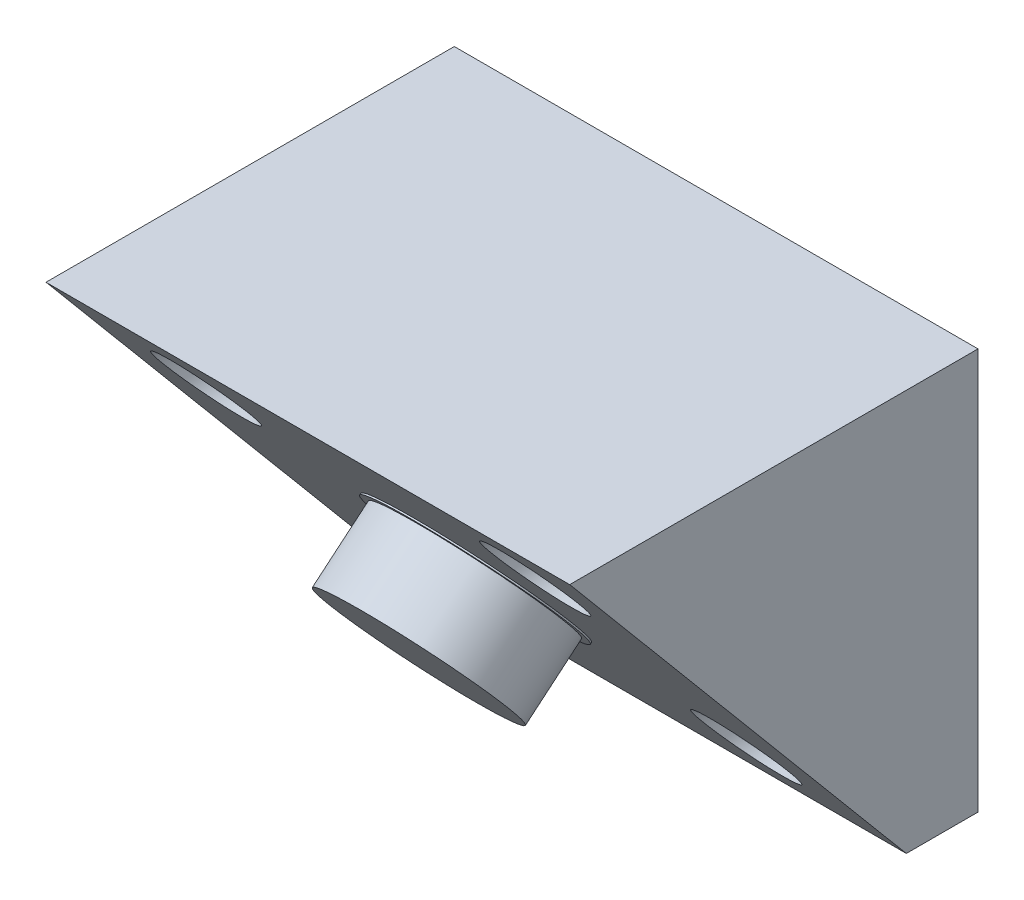
ISO-10303-21;
HEADER;
FILE_DESCRIPTION(('STEP AP214'),'2;1');
FILE_NAME('part.step','',(''),(''),'','','');
FILE_SCHEMA(('AUTOMOTIVE_DESIGN { 1 0 10303 214 1 1 1 1 }'));
ENDSEC;
DATA;
#1=APPLICATION_CONTEXT('core data for automotive mechanical design processes');
#2=APPLICATION_PROTOCOL_DEFINITION('international standard','automotive_design',2000,#1);
#3=PRODUCT_CONTEXT('',#1,'mechanical');
#4=PRODUCT('Part','Part','',(#3));
#5=PRODUCT_RELATED_PRODUCT_CATEGORY('part','',(#4));
#6=PRODUCT_DEFINITION_FORMATION('','',#4);
#7=PRODUCT_DEFINITION_CONTEXT('part definition',#1,'design');
#8=PRODUCT_DEFINITION('design','',#6,#7);
#9=PRODUCT_DEFINITION_SHAPE('','',#8);
#10=(LENGTH_UNIT() NAMED_UNIT(*) SI_UNIT(.MILLI.,.METRE.));
#11=(NAMED_UNIT(*) PLANE_ANGLE_UNIT() SI_UNIT($,.RADIAN.));
#12=(NAMED_UNIT(*) SI_UNIT($,.STERADIAN.) SOLID_ANGLE_UNIT());
#13=UNCERTAINTY_MEASURE_WITH_UNIT(LENGTH_MEASURE(1.E-05),#10,'distance_accuracy_value','');
#14=(GEOMETRIC_REPRESENTATION_CONTEXT(3) GLOBAL_UNCERTAINTY_ASSIGNED_CONTEXT((#13)) GLOBAL_UNIT_ASSIGNED_CONTEXT((#10,
#11,#12)) REPRESENTATION_CONTEXT('',''));
#15=CARTESIAN_POINT('',(0.,0.,0.));
#16=DIRECTION('',(0.,0.,1.));
#17=DIRECTION('',(1.,0.,0.));
#18=AXIS2_PLACEMENT_3D('',#15,#16,#17);
#19=CARTESIAN_POINT('',(35.,0.238005414940586,-27.0495609241047));
#20=DIRECTION('',(0.,1.,6.03609176530462E-13));
#21=DIRECTION('',(-1.,0.,0.));
#22=AXIS2_PLACEMENT_3D('',#19,#20,#21);
#23=PLANE('',#22);
#24=DIRECTION('',(0.,6.03609176530462E-13,-1.));
#25=VECTOR('',#24,1.);
#26=CARTESIAN_POINT('',(0.,0.238005414940586,-27.0495609241047));
#27=LINE('',#26,#25);
#28=CARTESIAN_POINT('',(0.,0.238005414937694,-22.2595609241047));
#29=VERTEX_POINT('',#28);
#30=CARTESIAN_POINT('',(0.,0.238005414940586,-27.0495609241047));
#31=VERTEX_POINT('',#30);
#32=EDGE_CURVE('E104',#29,#31,#27,.T.);
#33=ORIENTED_EDGE('',*,*,#32,.T.);
#34=DIRECTION('',(-1.,0.,0.));
#35=VECTOR('',#34,1.);
#36=CARTESIAN_POINT('',(35.,0.238005414940586,-27.0495609241047));
#37=LINE('',#36,#35);
#38=CARTESIAN_POINT('',(35.,0.238005414940586,-27.0495609241047));
#39=VERTEX_POINT('',#38);
#40=EDGE_CURVE('E45',#39,#31,#37,.T.);
#41=ORIENTED_EDGE('',*,*,#40,.F.);
#42=DIRECTION('',(0.,6.03609176530462E-13,-1.));
#43=VECTOR('',#42,1.);
#44=CARTESIAN_POINT('',(35.,0.238005414940586,-27.0495609241047));
#45=LINE('',#44,#43);
#46=CARTESIAN_POINT('',(35.,0.238005414937694,-22.2595609241047));
#47=VERTEX_POINT('',#46);
#48=EDGE_CURVE('E90',#47,#39,#45,.T.);
#49=ORIENTED_EDGE('',*,*,#48,.F.);
#50=DIRECTION('',(-1.,0.,0.));
#51=VECTOR('',#50,1.);
#52=CARTESIAN_POINT('',(35.,0.238005414937694,-22.2595609241047));
#53=LINE('',#52,#51);
#54=EDGE_CURVE('E100',#47,#29,#53,.T.);
#55=ORIENTED_EDGE('',*,*,#54,.T.);
#56=EDGE_LOOP('',(#33,#41,#49,#55));
#57=FACE_BOUND('',#56,.T.);
#58=ADVANCED_FACE('F36',(#57),#23,.F.);
#59=CARTESIAN_POINT('',(35.,0.238005414940586,-27.0495609241047));
#60=DIRECTION('',(0.,-6.03610556928924E-13,1.));
#61=DIRECTION('',(0.,-1.,-6.03610556928924E-13));
#62=AXIS2_PLACEMENT_3D('',#59,#60,#61);
#63=PLANE('',#62);
#64=CARTESIAN_POINT('',(6.5,22.0495609241048,-27.0495609240915));
#65=DIRECTION('',(0.,-6.03610556928924E-13,1.));
#66=DIRECTION('',(0.,-1.,-6.03610556928924E-13));
#67=AXIS2_PLACEMENT_3D('',#64,#65,#66);
#68=CIRCLE('',#67,1.7);
#69=CARTESIAN_POINT('',(6.5,20.3495609241048,-27.0495609240925));
#70=VERTEX_POINT('',#69);
#71=EDGE_CURVE('E349',#70,#70,#68,.T.);
#72=ORIENTED_EDGE('',*,*,#71,.T.);
#73=EDGE_LOOP('',(#72));
#74=FACE_BOUND('',#73,.T.);
#75=CARTESIAN_POINT('',(6.5,5.23800541494059,-27.0495609241017));
#76=DIRECTION('',(0.,-6.03610556928924E-13,1.));
#77=DIRECTION('',(0.,-1.,-6.03610556928924E-13));
#78=AXIS2_PLACEMENT_3D('',#75,#76,#77);
#79=CIRCLE('',#78,1.7);
#80=CARTESIAN_POINT('',(6.5,3.53800541494059,-27.0495609241027));
#81=VERTEX_POINT('',#80);
#82=EDGE_CURVE('E359',#81,#81,#79,.T.);
#83=ORIENTED_EDGE('',*,*,#82,.T.);
#84=EDGE_LOOP('',(#83));
#85=FACE_BOUND('',#84,.T.);
#86=CARTESIAN_POINT('',(28.5,5.23800541494059,-27.0495609241017));
#87=DIRECTION('',(0.,-6.03610556928924E-13,1.));
#88=DIRECTION('',(0.,-1.,-6.03610556928924E-13));
#89=AXIS2_PLACEMENT_3D('',#86,#87,#88);
#90=CIRCLE('',#89,1.7);
#91=CARTESIAN_POINT('',(28.5,3.53800541494059,-27.0495609241027));
#92=VERTEX_POINT('',#91);
#93=EDGE_CURVE('E365',#92,#92,#90,.T.);
#94=ORIENTED_EDGE('',*,*,#93,.T.);
#95=EDGE_LOOP('',(#94));
#96=FACE_BOUND('',#95,.T.);
#97=CARTESIAN_POINT('',(28.5,22.0495609241048,-27.0495609240915));
#98=DIRECTION('',(0.,-6.03610556928924E-13,1.));
#99=DIRECTION('',(0.,-1.,-6.03610556928924E-13));
#100=AXIS2_PLACEMENT_3D('',#97,#98,#99);
#101=CIRCLE('',#100,1.7);
#102=CARTESIAN_POINT('',(28.5,20.3495609241048,-27.0495609240925));
#103=VERTEX_POINT('',#102);
#104=EDGE_CURVE('E371',#103,#103,#101,.T.);
#105=ORIENTED_EDGE('',*,*,#104,.T.);
#106=EDGE_LOOP('',(#105));
#107=FACE_BOUND('',#106,.T.);
#108=DIRECTION('',(0.,1.,6.03610556928924E-13));
#109=VECTOR('',#108,1.);
#110=CARTESIAN_POINT('',(0.,0.238005414940586,-27.0495609241047));
#111=LINE('',#110,#109);
#112=CARTESIAN_POINT('',(0.,27.0495609241048,-27.0495609240885));
#113=VERTEX_POINT('',#112);
#114=EDGE_CURVE('E95',#31,#113,#111,.T.);
#115=ORIENTED_EDGE('',*,*,#114,.T.);
#116=DIRECTION('',(-1.,0.,0.));
#117=VECTOR('',#116,1.);
#118=CARTESIAN_POINT('',(35.,27.0495609241048,-27.0495609240885));
#119=LINE('',#118,#117);
#120=CARTESIAN_POINT('',(35.,27.0495609241048,-27.0495609240885));
#121=VERTEX_POINT('',#120);
#122=EDGE_CURVE('E93',#121,#113,#119,.T.);
#123=ORIENTED_EDGE('',*,*,#122,.F.);
#124=DIRECTION('',(0.,1.,6.03610556928924E-13));
#125=VECTOR('',#124,1.);
#126=CARTESIAN_POINT('',(35.,0.238005414940586,-27.0495609241047));
#127=LINE('',#126,#125);
#128=EDGE_CURVE('E85',#39,#121,#127,.T.);
#129=ORIENTED_EDGE('',*,*,#128,.F.);
#130=ORIENTED_EDGE('',*,*,#40,.T.);
#131=EDGE_LOOP('',(#115,#123,#129,#130));
#132=FACE_BOUND('',#131,.T.);
#133=ADVANCED_FACE('F94',(#74,#85,#96,#107,#132),#63,.F.);
#134=CARTESIAN_POINT('',(35.,27.0495609240883,0.238005414940436));
#135=DIRECTION('',(0.,-1.,-6.03736320406499E-13));
#136=DIRECTION('',(0.,6.03736320406499E-13,-1.));
#137=AXIS2_PLACEMENT_3D('',#134,#135,#136);
#138=PLANE('',#137);
#139=DIRECTION('',(0.,-6.03736320406499E-13,1.));
#140=VECTOR('',#139,1.);
#141=CARTESIAN_POINT('',(0.,27.0495609240883,0.238005414940436));
#142=LINE('',#141,#140);
#143=CARTESIAN_POINT('',(0.,27.0495609240883,0.238005414940436));
#144=VERTEX_POINT('',#143);
#145=EDGE_CURVE('E71',#113,#144,#142,.T.);
#146=ORIENTED_EDGE('',*,*,#145,.T.);
#147=DIRECTION('',(-1.,0.,0.));
#148=VECTOR('',#147,1.);
#149=CARTESIAN_POINT('',(35.,27.0495609240883,0.238005414940436));
#150=LINE('',#149,#148);
#151=CARTESIAN_POINT('',(35.,27.0495609240883,0.238005414940436));
#152=VERTEX_POINT('',#151);
#153=EDGE_CURVE('E96',#152,#144,#150,.T.);
#154=ORIENTED_EDGE('',*,*,#153,.F.);
#155=DIRECTION('',(0.,-6.03736320406499E-13,1.));
#156=VECTOR('',#155,1.);
#157=CARTESIAN_POINT('',(35.,27.0495609240883,0.238005414940436));
#158=LINE('',#157,#156);
#159=EDGE_CURVE('E88',#121,#152,#158,.T.);
#160=ORIENTED_EDGE('',*,*,#159,.F.);
#161=ORIENTED_EDGE('',*,*,#122,.T.);
#162=EDGE_LOOP('',(#146,#154,#160,#161));
#163=FACE_BOUND('',#162,.T.);
#164=ADVANCED_FACE('F98',(#163),#138,.F.);
#165=CARTESIAN_POINT('',(35.,0.238005414937694,-22.2595609241047));
#166=DIRECTION('',(0.,0.642787609687003,-0.766044443118589));
#167=DIRECTION('',(0.,0.766044443118589,0.642787609687003));
#168=AXIS2_PLACEMENT_3D('',#165,#166,#167);
#169=PLANE('',#168);
#170=CARTESIAN_POINT('',(6.5,22.0495609240908,-3.957492740949));
#171=DIRECTION('',(0.,0.642787609687003,-0.766044443118589));
#172=DIRECTION('',(0.,-0.766044443118589,-0.642787609687003));
#173=AXIS2_PLACEMENT_3D('',#170,#171,#172);
#174=ELLIPSE('',#173,3.720410774597,2.85);
#175=CARTESIAN_POINT('',(6.5,19.1995609240923,-6.34892668980598));
#176=VERTEX_POINT('',#175);
#177=EDGE_CURVE('E39',#176,#176,#174,.T.);
#178=ORIENTED_EDGE('',*,*,#177,.T.);
#179=EDGE_LOOP('',(#178));
#180=FACE_BOUND('',#179,.T.);
#181=CARTESIAN_POINT('',(6.5,5.23800541493517,-18.0640627682152));
#182=DIRECTION('',(0.,0.642787609687003,-0.766044443118589));
#183=DIRECTION('',(0.,-0.766044443118589,-0.642787609687003));
#184=AXIS2_PLACEMENT_3D('',#181,#182,#183);
#185=ELLIPSE('',#184,3.720410774597,2.85);
#186=CARTESIAN_POINT('',(6.5,2.38800541493661,-20.4554967170722));
#187=VERTEX_POINT('',#186);
#188=EDGE_CURVE('E124',#187,#187,#185,.T.);
#189=ORIENTED_EDGE('',*,*,#188,.T.);
#190=EDGE_LOOP('',(#189));
#191=FACE_BOUND('',#190,.T.);
#192=CARTESIAN_POINT('',(28.5,5.23800541493517,-18.0640627682152));
#193=DIRECTION('',(0.,0.642787609687003,-0.766044443118589));
#194=DIRECTION('',(0.,-0.766044443118589,-0.642787609687003));
#195=AXIS2_PLACEMENT_3D('',#192,#193,#194);
#196=ELLIPSE('',#195,3.720410774597,2.85);
#197=CARTESIAN_POINT('',(28.5,2.38800541493661,-20.4554967170722));
#198=VERTEX_POINT('',#197);
#199=EDGE_CURVE('E122',#198,#198,#196,.T.);
#200=ORIENTED_EDGE('',*,*,#199,.T.);
#201=EDGE_LOOP('',(#200));
#202=FACE_BOUND('',#201,.T.);
#203=CARTESIAN_POINT('',(28.5,22.0495609240908,-3.957492740949));
#204=DIRECTION('',(0.,0.642787609687003,-0.766044443118589));
#205=DIRECTION('',(0.,-0.766044443118589,-0.642787609687003));
#206=AXIS2_PLACEMENT_3D('',#203,#204,#205);
#207=ELLIPSE('',#206,3.720410774597,2.85);
#208=CARTESIAN_POINT('',(28.5,19.1995609240923,-6.34892668980597));
#209=VERTEX_POINT('',#208);
#210=EDGE_CURVE('E118',#209,#209,#207,.T.);
#211=ORIENTED_EDGE('',*,*,#210,.T.);
#212=EDGE_LOOP('',(#211));
#213=FACE_BOUND('',#212,.T.);
#214=CARTESIAN_POINT('',(17.5,13.643783169513,-11.0107777545821));
#215=DIRECTION('',(0.,0.642787609687003,-0.766044443118589));
#216=DIRECTION('',(0.,0.766044443118589,0.642787609687003));
#217=AXIS2_PLACEMENT_3D('',#214,#215,#216);
#218=CIRCLE('',#217,6.5);
#219=CARTESIAN_POINT('',(17.5,18.6230720497838,-6.8326582916166));
#220=VERTEX_POINT('',#219);
#221=EDGE_CURVE('E11',#220,#220,#218,.F.);
#222=ORIENTED_EDGE('',*,*,#221,.F.);
#223=EDGE_LOOP('',(#222));
#224=FACE_BOUND('',#223,.T.);
#225=DIRECTION('',(0.,-0.766044443118589,-0.642787609687003));
#226=VECTOR('',#225,1.);
#227=CARTESIAN_POINT('',(0.,0.238005414937694,-22.2595609241047));
#228=LINE('',#227,#226);
#229=EDGE_CURVE('E77',#144,#29,#228,.T.);
#230=ORIENTED_EDGE('',*,*,#229,.T.);
#231=ORIENTED_EDGE('',*,*,#54,.F.);
#232=DIRECTION('',(0.,-0.766044443118589,-0.642787609687003));
#233=VECTOR('',#232,1.);
#234=CARTESIAN_POINT('',(35.,0.238005414937694,-22.2595609241047));
#235=LINE('',#234,#233);
#236=EDGE_CURVE('E54',#152,#47,#235,.T.);
#237=ORIENTED_EDGE('',*,*,#236,.F.);
#238=ORIENTED_EDGE('',*,*,#153,.T.);
#239=EDGE_LOOP('',(#230,#231,#237,#238));
#240=FACE_BOUND('',#239,.T.);
#241=ADVANCED_FACE('F179',(#180,#191,#202,#213,#224,#240),#169,.F.);
#242=CARTESIAN_POINT('',(35.,0.238005414940586,-27.0495609241047));
#243=DIRECTION('',(-1.,0.,0.));
#244=DIRECTION('',(0.,-1.,-6.03609176530462E-13));
#245=AXIS2_PLACEMENT_3D('',#242,#243,#244);
#246=PLANE('',#245);
#247=ORIENTED_EDGE('',*,*,#48,.T.);
#248=ORIENTED_EDGE('',*,*,#128,.T.);
#249=ORIENTED_EDGE('',*,*,#159,.T.);
#250=ORIENTED_EDGE('',*,*,#236,.T.);
#251=EDGE_LOOP('',(#247,#248,#249,#250));
#252=FACE_BOUND('',#251,.T.);
#253=ADVANCED_FACE('F86',(#252),#246,.F.);
#254=CARTESIAN_POINT('',(0.,0.238005414940586,-27.0495609241047));
#255=DIRECTION('',(-1.,0.,0.));
#256=DIRECTION('',(0.,-1.,-6.03609176530462E-13));
#257=AXIS2_PLACEMENT_3D('',#254,#255,#256);
#258=PLANE('',#257);
#259=ORIENTED_EDGE('',*,*,#32,.F.);
#260=ORIENTED_EDGE('',*,*,#229,.F.);
#261=ORIENTED_EDGE('',*,*,#145,.F.);
#262=ORIENTED_EDGE('',*,*,#114,.F.);
#263=EDGE_LOOP('',(#259,#260,#261,#262));
#264=FACE_BOUND('',#263,.T.);
#265=ADVANCED_FACE('F169',(#264),#258,.T.);
#266=CARTESIAN_POINT('',(17.5,13.5795044085443,-10.9341733102703));
#267=DIRECTION('',(0.,0.642787609687003,-0.766044443118589));
#268=DIRECTION('',(0.,0.766044443118589,0.642787609687003));
#269=AXIS2_PLACEMENT_3D('',#266,#267,#268);
#270=CYLINDRICAL_SURFACE('',#269,6.5);
#271=CARTESIAN_POINT('',(17.5,13.5795044085443,-10.9341733102703));
#272=DIRECTION('',(0.,-0.642787609687003,0.766044443118589));
#273=DIRECTION('',(0.,-0.766044443118589,-0.642787609687003));
#274=AXIS2_PLACEMENT_3D('',#271,#272,#273);
#275=CIRCLE('',#274,6.5);
#276=CARTESIAN_POINT('',(17.5,8.60021552827348,-15.1122927732358));
#277=VERTEX_POINT('',#276);
#278=EDGE_CURVE('E116',#277,#277,#275,.T.);
#279=ORIENTED_EDGE('',*,*,#278,.F.);
#280=EDGE_LOOP('',(#279));
#281=FACE_BOUND('',#280,.T.);
#282=ORIENTED_EDGE('',*,*,#221,.T.);
#283=EDGE_LOOP('',(#282));
#284=FACE_BOUND('',#283,.T.);
#285=ADVANCED_FACE('F171',(#281,#284),#270,.T.);
#286=CARTESIAN_POINT('',(17.5,13.5795044085443,-10.9341733102703));
#287=DIRECTION('',(0.,-0.642787609687003,0.766044443118589));
#288=DIRECTION('',(0.,-0.766044443118589,-0.642787609687003));
#289=AXIS2_PLACEMENT_3D('',#286,#287,#288);
#290=PLANE('',#289);
#291=CARTESIAN_POINT('',(17.5,13.5795044085443,-10.9341733102703));
#292=DIRECTION('',(0.,-0.642787609687003,0.766044443118589));
#293=DIRECTION('',(0.,-0.766044443118589,-0.642787609687003));
#294=AXIS2_PLACEMENT_3D('',#291,#292,#293);
#295=CIRCLE('',#294,6.);
#296=CARTESIAN_POINT('',(17.5,8.98323774983277,-14.7908989683923));
#297=VERTEX_POINT('',#296);
#298=EDGE_CURVE('E114',#297,#297,#295,.T.);
#299=ORIENTED_EDGE('',*,*,#298,.F.);
#300=EDGE_LOOP('',(#299));
#301=FACE_BOUND('',#300,.T.);
#302=ORIENTED_EDGE('',*,*,#278,.T.);
#303=EDGE_LOOP('',(#302));
#304=FACE_BOUND('',#303,.T.);
#305=ADVANCED_FACE('F158',(#301,#304),#290,.T.);
#306=CARTESIAN_POINT('',(17.5,10.429845121078,-7.18055553898917));
#307=DIRECTION('',(0.,-0.642787609687004,0.766044443118589));
#308=DIRECTION('',(0.,-0.766044443118589,-0.642787609687004));
#309=AXIS2_PLACEMENT_3D('',#306,#307,#308);
#310=PLANE('',#309);
#311=CARTESIAN_POINT('',(17.5,10.429845121078,-7.18055553898917));
#312=DIRECTION('',(0.,-0.642787609687004,0.766044443118589));
#313=DIRECTION('',(0.,-0.766044443118589,-0.642787609687004));
#314=AXIS2_PLACEMENT_3D('',#311,#312,#313);
#315=CIRCLE('',#314,6.);
#316=CARTESIAN_POINT('',(17.5,5.83357846236645,-11.0372811971112));
#317=VERTEX_POINT('',#316);
#318=EDGE_CURVE('E107',#317,#317,#315,.T.);
#319=ORIENTED_EDGE('',*,*,#318,.T.);
#320=EDGE_LOOP('',(#319));
#321=FACE_BOUND('',#320,.T.);
#322=ADVANCED_FACE('F145',(#321),#310,.T.);
#323=CARTESIAN_POINT('',(17.5,10.429845121078,-7.18055553898917));
#324=DIRECTION('',(0.,0.642787609687004,-0.766044443118589));
#325=DIRECTION('',(0.,0.766044443118589,0.642787609687004));
#326=AXIS2_PLACEMENT_3D('',#323,#324,#325);
#327=CYLINDRICAL_SURFACE('',#326,6.);
#328=ORIENTED_EDGE('',*,*,#298,.T.);
#329=EDGE_LOOP('',(#328));
#330=FACE_BOUND('',#329,.T.);
#331=ORIENTED_EDGE('',*,*,#318,.F.);
#332=EDGE_LOOP('',(#331));
#333=FACE_BOUND('',#332,.T.);
#334=ADVANCED_FACE('F147',(#330,#333),#327,.T.);
#335=CARTESIAN_POINT('',(28.5,22.0495609240883,0.238005414937417));
#336=DIRECTION('',(0.,6.03610556928924E-13,-1.));
#337=DIRECTION('',(0.,1.,6.03610556928924E-13));
#338=AXIS2_PLACEMENT_3D('',#335,#336,#337);
#339=CYLINDRICAL_SURFACE('',#338,2.85);
#340=CARTESIAN_POINT('',(28.5,22.0495609241019,-22.2595609240915));
#341=DIRECTION('',(0.,6.03610556928924E-13,-1.));
#342=DIRECTION('',(0.,1.,6.03610556928924E-13));
#343=AXIS2_PLACEMENT_3D('',#340,#341,#342);
#344=CIRCLE('',#343,2.85);
#345=CARTESIAN_POINT('',(28.5,24.8995609241019,-22.2595609240898));
#346=VERTEX_POINT('',#345);
#347=EDGE_CURVE('E121',#346,#346,#344,.T.);
#348=ORIENTED_EDGE('',*,*,#347,.T.);
#349=EDGE_LOOP('',(#348));
#350=FACE_BOUND('',#349,.T.);
#351=ORIENTED_EDGE('',*,*,#210,.F.);
#352=EDGE_LOOP('',(#351));
#353=FACE_BOUND('',#352,.T.);
#354=ADVANCED_FACE('F149',(#350,#353),#339,.F.);
#355=CARTESIAN_POINT('',(28.5,22.0495609241019,-22.2595609240915));
#356=DIRECTION('',(0.,6.03610556928924E-13,-1.));
#357=DIRECTION('',(0.,1.,6.03610556928924E-13));
#358=AXIS2_PLACEMENT_3D('',#355,#356,#357);
#359=PLANE('',#358);
#360=CARTESIAN_POINT('',(28.5,22.0495609241019,-22.2595609240915));
#361=DIRECTION('',(0.,-6.03610556928924E-13,1.));
#362=DIRECTION('',(0.,-1.,-6.03610556928924E-13));
#363=AXIS2_PLACEMENT_3D('',#360,#361,#362);
#364=CIRCLE('',#363,1.7);
#365=CARTESIAN_POINT('',(28.5,20.3495609241019,-22.2595609240925));
#366=VERTEX_POINT('',#365);
#367=EDGE_CURVE('E368',#366,#366,#364,.T.);
#368=ORIENTED_EDGE('',*,*,#367,.F.);
#369=EDGE_LOOP('',(#368));
#370=FACE_BOUND('',#369,.T.);
#371=ORIENTED_EDGE('',*,*,#347,.F.);
#372=EDGE_LOOP('',(#371));
#373=FACE_BOUND('',#372,.T.);
#374=ADVANCED_FACE('F156',(#370,#373),#359,.F.);
#375=CARTESIAN_POINT('',(28.5,5.23800541492412,0.238005414927269));
#376=DIRECTION('',(0.,6.03610556928924E-13,-1.));
#377=DIRECTION('',(0.,1.,6.03610556928924E-13));
#378=AXIS2_PLACEMENT_3D('',#375,#376,#377);
#379=CYLINDRICAL_SURFACE('',#378,2.85);
#380=CARTESIAN_POINT('',(28.5,5.2380054149377,-22.2595609241017));
#381=DIRECTION('',(0.,6.03610556928924E-13,-1.));
#382=DIRECTION('',(0.,-1.,-6.03610556928924E-13));
#383=AXIS2_PLACEMENT_3D('',#380,#381,#382);
#384=CIRCLE('',#383,2.85);
#385=CARTESIAN_POINT('',(28.5,2.3880054149377,-22.2595609241034));
#386=VERTEX_POINT('',#385);
#387=EDGE_CURVE('E138',#386,#386,#384,.T.);
#388=ORIENTED_EDGE('',*,*,#387,.T.);
#389=EDGE_LOOP('',(#388));
#390=FACE_BOUND('',#389,.T.);
#391=ORIENTED_EDGE('',*,*,#199,.F.);
#392=EDGE_LOOP('',(#391));
#393=FACE_BOUND('',#392,.T.);
#394=ADVANCED_FACE('F242',(#390,#393),#379,.F.);
#395=CARTESIAN_POINT('',(28.5,5.2380054149377,-22.2595609241017));
#396=DIRECTION('',(0.,-6.03610556928924E-13,1.));
#397=DIRECTION('',(0.,-1.,-6.03610556928924E-13));
#398=AXIS2_PLACEMENT_3D('',#395,#396,#397);
#399=PLANE('',#398);
#400=CARTESIAN_POINT('',(28.5,5.2380054149377,-22.2595609241017));
#401=DIRECTION('',(0.,-6.03610556928924E-13,1.));
#402=DIRECTION('',(0.,-1.,-6.03610556928924E-13));
#403=AXIS2_PLACEMENT_3D('',#400,#401,#402);
#404=CIRCLE('',#403,1.7);
#405=CARTESIAN_POINT('',(28.5,3.5380054149377,-22.2595609241027));
#406=VERTEX_POINT('',#405);
#407=EDGE_CURVE('E362',#406,#406,#404,.T.);
#408=ORIENTED_EDGE('',*,*,#407,.F.);
#409=EDGE_LOOP('',(#408));
#410=FACE_BOUND('',#409,.T.);
#411=ORIENTED_EDGE('',*,*,#387,.F.);
#412=EDGE_LOOP('',(#411));
#413=FACE_BOUND('',#412,.T.);
#414=ADVANCED_FACE('F252',(#410,#413),#399,.T.);
#415=CARTESIAN_POINT('',(6.5,5.23800541492412,0.238005414927269));
#416=DIRECTION('',(0.,6.03610556928924E-13,-1.));
#417=DIRECTION('',(0.,1.,6.03610556928924E-13));
#418=AXIS2_PLACEMENT_3D('',#415,#416,#417);
#419=CYLINDRICAL_SURFACE('',#418,2.85);
#420=CARTESIAN_POINT('',(6.5,5.2380054149377,-22.2595609241017));
#421=DIRECTION('',(0.,6.03610556928924E-13,-1.));
#422=DIRECTION('',(0.,1.,6.03610556928924E-13));
#423=AXIS2_PLACEMENT_3D('',#420,#421,#422);
#424=CIRCLE('',#423,2.85);
#425=CARTESIAN_POINT('',(6.5,8.0880054149377,-22.2595609240999));
#426=VERTEX_POINT('',#425);
#427=EDGE_CURVE('E375',#426,#426,#424,.T.);
#428=ORIENTED_EDGE('',*,*,#427,.T.);
#429=EDGE_LOOP('',(#428));
#430=FACE_BOUND('',#429,.T.);
#431=ORIENTED_EDGE('',*,*,#188,.F.);
#432=EDGE_LOOP('',(#431));
#433=FACE_BOUND('',#432,.T.);
#434=ADVANCED_FACE('F262',(#430,#433),#419,.F.);
#435=CARTESIAN_POINT('',(6.5,5.2380054149377,-22.2595609241017));
#436=DIRECTION('',(0.,6.03610556928924E-13,-1.));
#437=DIRECTION('',(0.,1.,6.03610556928924E-13));
#438=AXIS2_PLACEMENT_3D('',#435,#436,#437);
#439=PLANE('',#438);
#440=CARTESIAN_POINT('',(6.5,5.2380054149377,-22.2595609241017));
#441=DIRECTION('',(0.,-6.03610556928924E-13,1.));
#442=DIRECTION('',(0.,-1.,-6.03610556928924E-13));
#443=AXIS2_PLACEMENT_3D('',#440,#441,#442);
#444=CIRCLE('',#443,1.7);
#445=CARTESIAN_POINT('',(6.5,3.5380054149377,-22.2595609241027));
#446=VERTEX_POINT('',#445);
#447=EDGE_CURVE('E354',#446,#446,#444,.T.);
#448=ORIENTED_EDGE('',*,*,#447,.F.);
#449=EDGE_LOOP('',(#448));
#450=FACE_BOUND('',#449,.T.);
#451=ORIENTED_EDGE('',*,*,#427,.F.);
#452=EDGE_LOOP('',(#451));
#453=FACE_BOUND('',#452,.T.);
#454=ADVANCED_FACE('F272',(#450,#453),#439,.F.);
#455=CARTESIAN_POINT('',(6.5,22.0495609240883,0.238005414937417));
#456=DIRECTION('',(0.,6.03610556928924E-13,-1.));
#457=DIRECTION('',(0.,1.,6.03610556928924E-13));
#458=AXIS2_PLACEMENT_3D('',#455,#456,#457);
#459=CYLINDRICAL_SURFACE('',#458,2.85);
#460=CARTESIAN_POINT('',(6.5,22.0495609241019,-22.2595609240915));
#461=DIRECTION('',(0.,6.03610556928924E-13,-1.));
#462=DIRECTION('',(0.,-1.,-6.03610556928924E-13));
#463=AXIS2_PLACEMENT_3D('',#460,#461,#462);
#464=CIRCLE('',#463,2.85);
#465=CARTESIAN_POINT('',(6.5,19.1995609241019,-22.2595609240932));
#466=VERTEX_POINT('',#465);
#467=EDGE_CURVE('E125',#466,#466,#464,.T.);
#468=ORIENTED_EDGE('',*,*,#467,.T.);
#469=EDGE_LOOP('',(#468));
#470=FACE_BOUND('',#469,.T.);
#471=ORIENTED_EDGE('',*,*,#177,.F.);
#472=EDGE_LOOP('',(#471));
#473=FACE_BOUND('',#472,.T.);
#474=ADVANCED_FACE('F282',(#470,#473),#459,.F.);
#475=CARTESIAN_POINT('',(6.5,22.0495609241019,-22.2595609240915));
#476=DIRECTION('',(0.,-6.03610556928924E-13,1.));
#477=DIRECTION('',(0.,-1.,-6.03610556928924E-13));
#478=AXIS2_PLACEMENT_3D('',#475,#476,#477);
#479=PLANE('',#478);
#480=CARTESIAN_POINT('',(6.5,22.0495609241019,-22.2595609240915));
#481=DIRECTION('',(0.,-6.03610556928924E-13,1.));
#482=DIRECTION('',(0.,-1.,-6.03610556928924E-13));
#483=AXIS2_PLACEMENT_3D('',#480,#481,#482);
#484=CIRCLE('',#483,1.7);
#485=CARTESIAN_POINT('',(6.5,20.3495609241019,-22.2595609240925));
#486=VERTEX_POINT('',#485);
#487=EDGE_CURVE('E352',#486,#486,#484,.T.);
#488=ORIENTED_EDGE('',*,*,#487,.F.);
#489=EDGE_LOOP('',(#488));
#490=FACE_BOUND('',#489,.T.);
#491=ORIENTED_EDGE('',*,*,#467,.F.);
#492=EDGE_LOOP('',(#491));
#493=FACE_BOUND('',#492,.T.);
#494=ADVANCED_FACE('F292',(#490,#493),#479,.T.);
#495=CARTESIAN_POINT('',(28.5,22.0495609241019,-22.2595609240915));
#496=DIRECTION('',(0.,-6.03610556928924E-13,1.));
#497=DIRECTION('',(0.,-1.,-6.03610556928924E-13));
#498=AXIS2_PLACEMENT_3D('',#495,#496,#497);
#499=CYLINDRICAL_SURFACE('',#498,1.7);
#500=ORIENTED_EDGE('',*,*,#104,.F.);
#501=EDGE_LOOP('',(#500));
#502=FACE_BOUND('',#501,.T.);
#503=ORIENTED_EDGE('',*,*,#367,.T.);
#504=EDGE_LOOP('',(#503));
#505=FACE_BOUND('',#504,.T.);
#506=ADVANCED_FACE('F302',(#502,#505),#499,.F.);
#507=CARTESIAN_POINT('',(28.5,5.2380054149377,-22.2595609241017));
#508=DIRECTION('',(0.,-6.03610556928924E-13,1.));
#509=DIRECTION('',(0.,-1.,-6.03610556928924E-13));
#510=AXIS2_PLACEMENT_3D('',#507,#508,#509);
#511=CYLINDRICAL_SURFACE('',#510,1.7);
#512=ORIENTED_EDGE('',*,*,#93,.F.);
#513=EDGE_LOOP('',(#512));
#514=FACE_BOUND('',#513,.T.);
#515=ORIENTED_EDGE('',*,*,#407,.T.);
#516=EDGE_LOOP('',(#515));
#517=FACE_BOUND('',#516,.T.);
#518=ADVANCED_FACE('F312',(#514,#517),#511,.F.);
#519=CARTESIAN_POINT('',(6.5,5.2380054149377,-22.2595609241017));
#520=DIRECTION('',(0.,-6.03610556928924E-13,1.));
#521=DIRECTION('',(0.,-1.,-6.03610556928924E-13));
#522=AXIS2_PLACEMENT_3D('',#519,#520,#521);
#523=CYLINDRICAL_SURFACE('',#522,1.7);
#524=ORIENTED_EDGE('',*,*,#82,.F.);
#525=EDGE_LOOP('',(#524));
#526=FACE_BOUND('',#525,.T.);
#527=ORIENTED_EDGE('',*,*,#447,.T.);
#528=EDGE_LOOP('',(#527));
#529=FACE_BOUND('',#528,.T.);
#530=ADVANCED_FACE('F322',(#526,#529),#523,.F.);
#531=CARTESIAN_POINT('',(6.5,22.0495609241019,-22.2595609240915));
#532=DIRECTION('',(0.,-6.03610556928924E-13,1.));
#533=DIRECTION('',(0.,-1.,-6.03610556928924E-13));
#534=AXIS2_PLACEMENT_3D('',#531,#532,#533);
#535=CYLINDRICAL_SURFACE('',#534,1.7);
#536=ORIENTED_EDGE('',*,*,#71,.F.);
#537=EDGE_LOOP('',(#536));
#538=FACE_BOUND('',#537,.T.);
#539=ORIENTED_EDGE('',*,*,#487,.T.);
#540=EDGE_LOOP('',(#539));
#541=FACE_BOUND('',#540,.T.);
#542=ADVANCED_FACE('F332',(#538,#541),#535,.F.);
#543=CLOSED_SHELL('',(#58,#133,#164,#241,#253,#265,#285,#305,#322,#334,#354,#374,#394,#414,#434,
#454,#474,#494,#506,#518,#530,#542));
#544=MANIFOLD_SOLID_BREP('B2',#543);
#545=ADVANCED_BREP_SHAPE_REPRESENTATION('',(#18,#544),#14);
#546=SHAPE_DEFINITION_REPRESENTATION(#9,#545);
ENDSEC;
END-ISO-10303-21;
